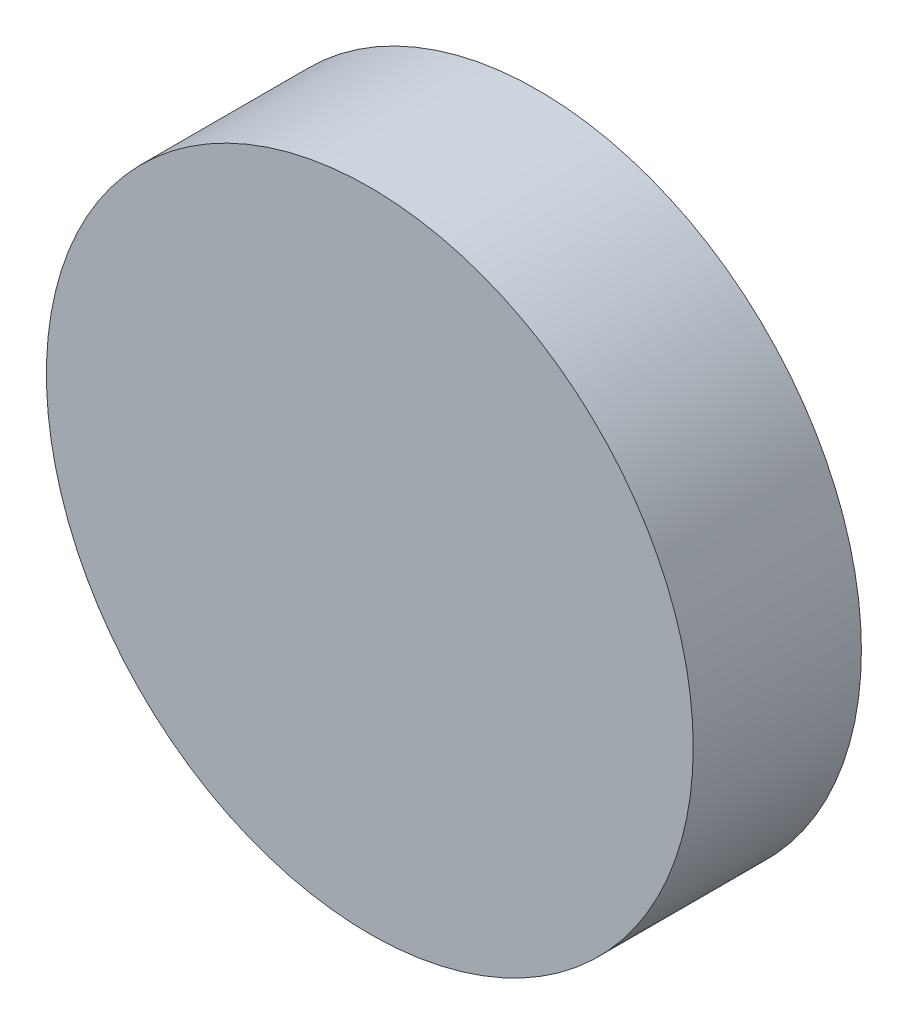
ISO-10303-21;
HEADER;
FILE_DESCRIPTION(('STEP AP214'),'2;1');
FILE_NAME('part.step','',(''),(''),'','','');
FILE_SCHEMA(('AUTOMOTIVE_DESIGN { 1 0 10303 214 1 1 1 1 }'));
ENDSEC;
DATA;
#1=APPLICATION_CONTEXT('core data for automotive mechanical design processes');
#2=APPLICATION_PROTOCOL_DEFINITION('international standard','automotive_design',2000,#1);
#3=PRODUCT_CONTEXT('',#1,'mechanical');
#4=PRODUCT('Part','Part','',(#3));
#5=PRODUCT_RELATED_PRODUCT_CATEGORY('part','',(#4));
#6=PRODUCT_DEFINITION_FORMATION('','',#4);
#7=PRODUCT_DEFINITION_CONTEXT('part definition',#1,'design');
#8=PRODUCT_DEFINITION('design','',#6,#7);
#9=PRODUCT_DEFINITION_SHAPE('','',#8);
#10=(LENGTH_UNIT() NAMED_UNIT(*) SI_UNIT(.MILLI.,.METRE.));
#11=(NAMED_UNIT(*) PLANE_ANGLE_UNIT() SI_UNIT($,.RADIAN.));
#12=(NAMED_UNIT(*) SI_UNIT($,.STERADIAN.) SOLID_ANGLE_UNIT());
#13=UNCERTAINTY_MEASURE_WITH_UNIT(LENGTH_MEASURE(1.E-05),#10,'distance_accuracy_value','');
#14=(GEOMETRIC_REPRESENTATION_CONTEXT(3) GLOBAL_UNCERTAINTY_ASSIGNED_CONTEXT((#13)) GLOBAL_UNIT_ASSIGNED_CONTEXT((#10,
#11,#12)) REPRESENTATION_CONTEXT('',''));
#15=CARTESIAN_POINT('',(0.,0.,0.));
#16=DIRECTION('',(0.,0.,1.));
#17=DIRECTION('',(1.,0.,0.));
#18=AXIS2_PLACEMENT_3D('',#15,#16,#17);
#19=CARTESIAN_POINT('',(0.,189.,50.84));
#20=DIRECTION('',(0.,0.,1.));
#21=DIRECTION('',(1.,0.,0.));
#22=AXIS2_PLACEMENT_3D('',#19,#20,#21);
#23=PLANE('',#22);
#24=CARTESIAN_POINT('',(0.,189.,50.84));
#25=DIRECTION('',(0.,0.,1.));
#26=DIRECTION('',(1.,0.,0.));
#27=AXIS2_PLACEMENT_3D('',#24,#25,#26);
#28=CIRCLE('',#27,25.);
#29=CARTESIAN_POINT('',(25.,189.,50.84));
#30=VERTEX_POINT('',#29);
#31=EDGE_CURVE('E17',#30,#30,#28,.F.);
#32=ORIENTED_EDGE('',*,*,#31,.F.);
#33=EDGE_LOOP('',(#32));
#34=FACE_BOUND('',#33,.T.);
#35=ADVANCED_FACE('F14',(#34),#23,.T.);
#36=CARTESIAN_POINT('',(0.,189.,37.84));
#37=DIRECTION('',(0.,0.,1.));
#38=DIRECTION('',(1.,0.,0.));
#39=AXIS2_PLACEMENT_3D('',#36,#37,#38);
#40=PLANE('',#39);
#41=CARTESIAN_POINT('',(0.,189.,37.84));
#42=DIRECTION('',(0.,0.,1.));
#43=DIRECTION('',(1.,0.,0.));
#44=AXIS2_PLACEMENT_3D('',#41,#42,#43);
#45=CIRCLE('',#44,25.);
#46=CARTESIAN_POINT('',(25.,189.,37.84));
#47=VERTEX_POINT('',#46);
#48=EDGE_CURVE('E10',#47,#47,#45,.T.);
#49=ORIENTED_EDGE('',*,*,#48,.F.);
#50=EDGE_LOOP('',(#49));
#51=FACE_BOUND('',#50,.T.);
#52=ADVANCED_FACE('F29',(#51),#40,.F.);
#53=CARTESIAN_POINT('',(0.,189.,37.84));
#54=DIRECTION('',(0.,0.,1.));
#55=DIRECTION('',(1.,0.,0.));
#56=AXIS2_PLACEMENT_3D('',#53,#54,#55);
#57=CYLINDRICAL_SURFACE('',#56,25.);
#58=ORIENTED_EDGE('',*,*,#48,.T.);
#59=EDGE_LOOP('',(#58));
#60=FACE_BOUND('',#59,.T.);
#61=ORIENTED_EDGE('',*,*,#31,.T.);
#62=EDGE_LOOP('',(#61));
#63=FACE_BOUND('',#62,.T.);
#64=ADVANCED_FACE('F26',(#60,#63),#57,.T.);
#65=CLOSED_SHELL('',(#35,#52,#64));
#66=MANIFOLD_SOLID_BREP('B1',#65);
#67=ADVANCED_BREP_SHAPE_REPRESENTATION('',(#18,#66),#14);
#68=SHAPE_DEFINITION_REPRESENTATION(#9,#67);
ENDSEC;
END-ISO-10303-21;
